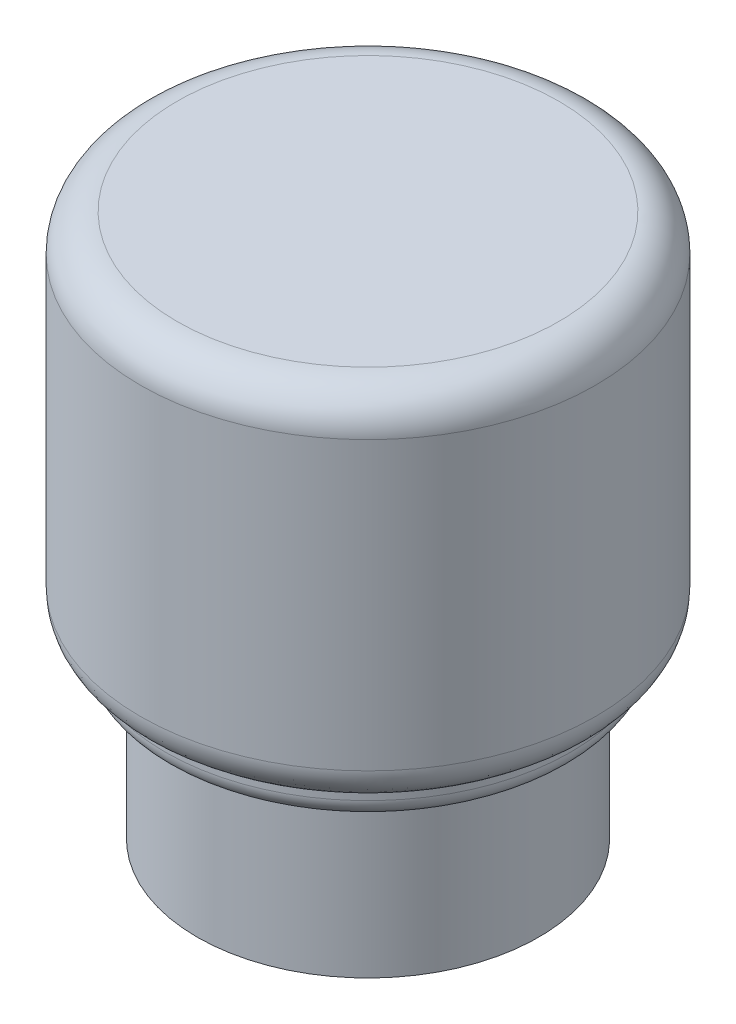
ISO-10303-21;
HEADER;
FILE_DESCRIPTION(('STEP AP214'),'2;1');
FILE_NAME('part.step','',(''),(''),'','','');
FILE_SCHEMA(('AUTOMOTIVE_DESIGN { 1 0 10303 214 1 1 1 1 }'));
ENDSEC;
DATA;
#1=APPLICATION_CONTEXT('core data for automotive mechanical design processes');
#2=APPLICATION_PROTOCOL_DEFINITION('international standard','automotive_design',2000,#1);
#3=PRODUCT_CONTEXT('',#1,'mechanical');
#4=PRODUCT('Part','Part','',(#3));
#5=PRODUCT_RELATED_PRODUCT_CATEGORY('part','',(#4));
#6=PRODUCT_DEFINITION_FORMATION('','',#4);
#7=PRODUCT_DEFINITION_CONTEXT('part definition',#1,'design');
#8=PRODUCT_DEFINITION('design','',#6,#7);
#9=PRODUCT_DEFINITION_SHAPE('','',#8);
#10=(LENGTH_UNIT() NAMED_UNIT(*) SI_UNIT(.MILLI.,.METRE.));
#11=(NAMED_UNIT(*) PLANE_ANGLE_UNIT() SI_UNIT($,.RADIAN.));
#12=(NAMED_UNIT(*) SI_UNIT($,.STERADIAN.) SOLID_ANGLE_UNIT());
#13=UNCERTAINTY_MEASURE_WITH_UNIT(LENGTH_MEASURE(1.E-05),#10,'distance_accuracy_value','');
#14=(GEOMETRIC_REPRESENTATION_CONTEXT(3) GLOBAL_UNCERTAINTY_ASSIGNED_CONTEXT((#13)) GLOBAL_UNIT_ASSIGNED_CONTEXT((#10,
#11,#12)) REPRESENTATION_CONTEXT('',''));
#15=CARTESIAN_POINT('',(0.,0.,0.));
#16=DIRECTION('',(0.,0.,1.));
#17=DIRECTION('',(1.,0.,0.));
#18=AXIS2_PLACEMENT_3D('',#15,#16,#17);
#19=CARTESIAN_POINT('',(-1.19125807242426,14.4856908885345,0.));
#20=DIRECTION('',(0.,1.,0.));
#21=DIRECTION('',(0.,0.,1.));
#22=AXIS2_PLACEMENT_3D('',#19,#20,#21);
#23=PLANE('',#22);
#24=CARTESIAN_POINT('',(-1.19125807242426,14.4856908885345,0.));
#25=DIRECTION('',(0.,1.,0.));
#26=DIRECTION('',(0.,0.,1.));
#27=AXIS2_PLACEMENT_3D('',#24,#25,#26);
#28=CIRCLE('',#27,5.19125807242426);
#29=CARTESIAN_POINT('',(-1.19125807242426,14.4856908885345,5.19125807242426));
#30=VERTEX_POINT('',#29);
#31=EDGE_CURVE('E48',#30,#30,#28,.T.);
#32=ORIENTED_EDGE('',*,*,#31,.T.);
#33=EDGE_LOOP('',(#32));
#34=FACE_BOUND('',#33,.T.);
#35=ADVANCED_FACE('F33',(#34),#23,.T.);
#36=CARTESIAN_POINT('',(-1.19125807242426,7.59409459127897,0.));
#37=DIRECTION('',(0.,-1.,0.));
#38=DIRECTION('',(0.,0.,-1.));
#39=AXIS2_PLACEMENT_3D('',#36,#37,#38);
#40=CYLINDRICAL_SURFACE('',#39,6.19125807242426);
#41=CARTESIAN_POINT('',(-1.19125807242426,5.68389467491038,0.));
#42=DIRECTION('',(0.,-1.,0.));
#43=DIRECTION('',(0.,0.,-1.));
#44=AXIS2_PLACEMENT_3D('',#41,#42,#43);
#45=CIRCLE('',#44,6.19125807242426);
#46=CARTESIAN_POINT('',(-1.19125807242426,5.68389467491038,-6.19125807242426));
#47=VERTEX_POINT('',#46);
#48=EDGE_CURVE('E44',#47,#47,#45,.F.);
#49=ORIENTED_EDGE('',*,*,#48,.T.);
#50=EDGE_LOOP('',(#49));
#51=FACE_BOUND('',#50,.T.);
#52=CARTESIAN_POINT('',(-1.19125807242426,13.4856908885345,0.));
#53=DIRECTION('',(0.,1.,0.));
#54=DIRECTION('',(0.,0.,1.));
#55=AXIS2_PLACEMENT_3D('',#52,#53,#54);
#56=CIRCLE('',#55,6.19125807242426);
#57=CARTESIAN_POINT('',(-1.19125807242426,13.4856908885345,6.19125807242426));
#58=VERTEX_POINT('',#57);
#59=EDGE_CURVE('E53',#58,#58,#56,.F.);
#60=ORIENTED_EDGE('',*,*,#59,.T.);
#61=EDGE_LOOP('',(#60));
#62=FACE_BOUND('',#61,.T.);
#63=ADVANCED_FACE('F82',(#51,#62),#40,.T.);
#64=CARTESIAN_POINT('',(-1.19125807242426,7.59409459127897,0.));
#65=DIRECTION('',(0.,-1.,0.));
#66=DIRECTION('',(0.,0.,-1.));
#67=AXIS2_PLACEMENT_3D('',#64,#65,#66);
#68=CYLINDRICAL_SURFACE('',#67,5.51166753551946);
#69=CARTESIAN_POINT('',(-1.19125807242426,4.50224340037128,0.));
#70=DIRECTION('',(0.,-1.,0.));
#71=DIRECTION('',(0.,0.,-1.));
#72=AXIS2_PLACEMENT_3D('',#69,#70,#71);
#73=CIRCLE('',#72,5.51166753551946);
#74=CARTESIAN_POINT('',(-1.19125807242426,4.50224340037128,-5.51166753551946));
#75=VERTEX_POINT('',#74);
#76=EDGE_CURVE('E10',#75,#75,#73,.F.);
#77=ORIENTED_EDGE('',*,*,#76,.T.);
#78=EDGE_LOOP('',(#77));
#79=FACE_BOUND('',#78,.T.);
#80=CARTESIAN_POINT('',(-1.19125807242426,4.73661553127897,0.));
#81=DIRECTION('',(0.,-1.,0.));
#82=DIRECTION('',(0.,0.,-1.));
#83=AXIS2_PLACEMENT_3D('',#80,#81,#82);
#84=CIRCLE('',#83,5.51166753551946);
#85=CARTESIAN_POINT('',(-1.19125807242426,4.73661553127897,-5.51166753551946));
#86=VERTEX_POINT('',#85);
#87=EDGE_CURVE('E56',#86,#86,#84,.T.);
#88=ORIENTED_EDGE('',*,*,#87,.T.);
#89=EDGE_LOOP('',(#88));
#90=FACE_BOUND('',#89,.T.);
#91=ADVANCED_FACE('F79',(#79,#90),#68,.T.);
#92=CARTESIAN_POINT('',(4.3204094630952,4.00224340037128,0.));
#93=DIRECTION('',(0.,-1.,0.));
#94=DIRECTION('',(0.,0.,-1.));
#95=AXIS2_PLACEMENT_3D('',#92,#93,#94);
#96=PLANE('',#95);
#97=CARTESIAN_POINT('',(-1.19125807242426,4.00224340037128,0.));
#98=DIRECTION('',(0.,-1.,0.));
#99=DIRECTION('',(0.,0.,-1.));
#100=AXIS2_PLACEMENT_3D('',#97,#98,#99);
#101=CIRCLE('',#100,5.01166753551946);
#102=CARTESIAN_POINT('',(-1.19125807242426,4.00224340037128,-5.01166753551946));
#103=VERTEX_POINT('',#102);
#104=EDGE_CURVE('E40',#103,#103,#101,.T.);
#105=ORIENTED_EDGE('',*,*,#104,.T.);
#106=EDGE_LOOP('',(#105));
#107=FACE_BOUND('',#106,.T.);
#108=CARTESIAN_POINT('',(-1.19125807242426,4.00224340037128,0.));
#109=DIRECTION('',(0.,-1.,0.));
#110=DIRECTION('',(0.,0.,-1.));
#111=AXIS2_PLACEMENT_3D('',#108,#109,#110);
#112=CIRCLE('',#111,4.64692772920625);
#113=CARTESIAN_POINT('',(-1.19125807242426,4.00224340037128,-4.64692772920625));
#114=VERTEX_POINT('',#113);
#115=EDGE_CURVE('E59',#114,#114,#112,.T.);
#116=ORIENTED_EDGE('',*,*,#115,.F.);
#117=EDGE_LOOP('',(#116));
#118=FACE_BOUND('',#117,.T.);
#119=ADVANCED_FACE('F70',(#107,#118),#96,.T.);
#120=CARTESIAN_POINT('',(-1.19125807242426,7.59409459127897,0.));
#121=DIRECTION('',(0.,-1.,0.));
#122=DIRECTION('',(0.,0.,-1.));
#123=AXIS2_PLACEMENT_3D('',#120,#121,#122);
#124=CYLINDRICAL_SURFACE('',#123,4.64692772920625);
#125=ORIENTED_EDGE('',*,*,#115,.T.);
#126=EDGE_LOOP('',(#125));
#127=FACE_BOUND('',#126,.T.);
#128=CARTESIAN_POINT('',(-1.19125807242426,-0.286866038942259,0.));
#129=DIRECTION('',(0.,-1.,0.));
#130=DIRECTION('',(0.,0.,-1.));
#131=AXIS2_PLACEMENT_3D('',#128,#129,#130);
#132=CIRCLE('',#131,4.64692772920625);
#133=CARTESIAN_POINT('',(-1.19125807242426,-0.286866038942259,-4.64692772920625));
#134=VERTEX_POINT('',#133);
#135=EDGE_CURVE('E62',#134,#134,#132,.T.);
#136=ORIENTED_EDGE('',*,*,#135,.F.);
#137=EDGE_LOOP('',(#136));
#138=FACE_BOUND('',#137,.T.);
#139=ADVANCED_FACE('F68',(#127,#138),#124,.T.);
#140=CARTESIAN_POINT('',(3.45566965678199,-0.286866038942259,0.));
#141=DIRECTION('',(0.,-1.,0.));
#142=DIRECTION('',(0.,0.,-1.));
#143=AXIS2_PLACEMENT_3D('',#140,#141,#142);
#144=PLANE('',#143);
#145=ORIENTED_EDGE('',*,*,#135,.T.);
#146=EDGE_LOOP('',(#145));
#147=FACE_BOUND('',#146,.T.);
#148=ADVANCED_FACE('F66',(#147),#144,.T.);
#149=CARTESIAN_POINT('',(-1.19125807242426,13.4856908885345,0.));
#150=DIRECTION('',(0.,1.,0.));
#151=DIRECTION('',(0.,0.,1.));
#152=AXIS2_PLACEMENT_3D('',#149,#150,#151);
#153=TOROIDAL_SURFACE('',#152,5.19125807242426,1.);
#154=ORIENTED_EDGE('',*,*,#31,.F.);
#155=EDGE_LOOP('',(#154));
#156=FACE_BOUND('',#155,.T.);
#157=ORIENTED_EDGE('',*,*,#59,.F.);
#158=EDGE_LOOP('',(#157));
#159=FACE_BOUND('',#158,.T.);
#160=ADVANCED_FACE('F77',(#156,#159),#153,.T.);
#161=CARTESIAN_POINT('',(-1.19125807242426,5.68389467491038,0.));
#162=DIRECTION('',(0.,-1.,0.));
#163=DIRECTION('',(0.,0.,-1.));
#164=AXIS2_PLACEMENT_3D('',#161,#162,#163);
#165=TOROIDAL_SURFACE('',#164,5.19125807242426,1.);
#166=ORIENTED_EDGE('',*,*,#48,.F.);
#167=EDGE_LOOP('',(#166));
#168=FACE_BOUND('',#167,.T.);
#169=ORIENTED_EDGE('',*,*,#87,.F.);
#170=EDGE_LOOP('',(#169));
#171=FACE_BOUND('',#170,.T.);
#172=ADVANCED_FACE('F93',(#168,#171),#165,.T.);
#173=CARTESIAN_POINT('',(-1.19125807242426,4.50224340037128,0.));
#174=DIRECTION('',(0.,-1.,0.));
#175=DIRECTION('',(0.,0.,-1.));
#176=AXIS2_PLACEMENT_3D('',#173,#174,#175);
#177=TOROIDAL_SURFACE('',#176,5.01166753551946,0.5);
#178=ORIENTED_EDGE('',*,*,#76,.F.);
#179=EDGE_LOOP('',(#178));
#180=FACE_BOUND('',#179,.T.);
#181=ORIENTED_EDGE('',*,*,#104,.F.);
#182=EDGE_LOOP('',(#181));
#183=FACE_BOUND('',#182,.T.);
#184=ADVANCED_FACE('F35',(#180,#183),#177,.T.);
#185=CLOSED_SHELL('',(#35,#63,#91,#119,#139,#148,#160,#172,#184));
#186=MANIFOLD_SOLID_BREP('B2',#185);
#187=ADVANCED_BREP_SHAPE_REPRESENTATION('',(#18,#186),#14);
#188=SHAPE_DEFINITION_REPRESENTATION(#9,#187);
ENDSEC;
END-ISO-10303-21;
